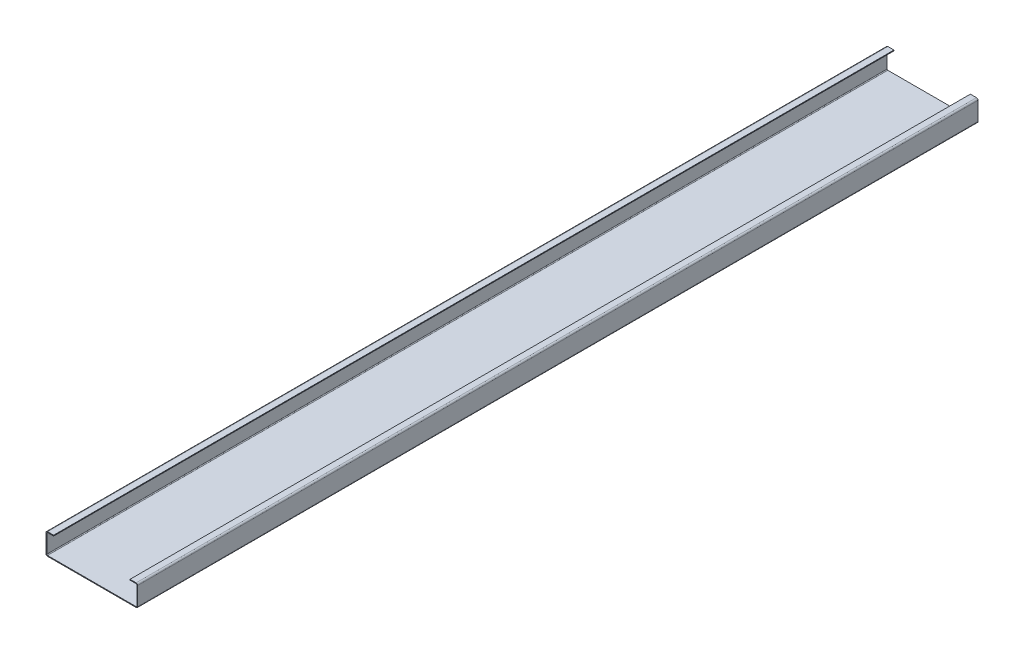
ISO-10303-21;
HEADER;
FILE_DESCRIPTION(('STEP AP214'),'2;1');
FILE_NAME('part.step','',(''),(''),'','','');
FILE_SCHEMA(('AUTOMOTIVE_DESIGN { 1 0 10303 214 1 1 1 1 }'));
ENDSEC;
DATA;
#1=APPLICATION_CONTEXT('core data for automotive mechanical design processes');
#2=APPLICATION_PROTOCOL_DEFINITION('international standard','automotive_design',2000,#1);
#3=PRODUCT_CONTEXT('',#1,'mechanical');
#4=PRODUCT('Part','Part','',(#3));
#5=PRODUCT_RELATED_PRODUCT_CATEGORY('part','',(#4));
#6=PRODUCT_DEFINITION_FORMATION('','',#4);
#7=PRODUCT_DEFINITION_CONTEXT('part definition',#1,'design');
#8=PRODUCT_DEFINITION('design','',#6,#7);
#9=PRODUCT_DEFINITION_SHAPE('','',#8);
#10=(LENGTH_UNIT() NAMED_UNIT(*) SI_UNIT(.MILLI.,.METRE.));
#11=(NAMED_UNIT(*) PLANE_ANGLE_UNIT() SI_UNIT($,.RADIAN.));
#12=(NAMED_UNIT(*) SI_UNIT($,.STERADIAN.) SOLID_ANGLE_UNIT());
#13=UNCERTAINTY_MEASURE_WITH_UNIT(LENGTH_MEASURE(1.E-05),#10,'distance_accuracy_value','');
#14=(GEOMETRIC_REPRESENTATION_CONTEXT(3) GLOBAL_UNCERTAINTY_ASSIGNED_CONTEXT((#13)) GLOBAL_UNIT_ASSIGNED_CONTEXT((#10,
#11,#12)) REPRESENTATION_CONTEXT('',''));
#15=CARTESIAN_POINT('',(0.,0.,0.));
#16=DIRECTION('',(0.,0.,1.));
#17=DIRECTION('',(1.,0.,0.));
#18=AXIS2_PLACEMENT_3D('',#15,#16,#17);
#19=CARTESIAN_POINT('',(-40.,0.,5500.));
#20=DIRECTION('',(0.,0.,1.));
#21=DIRECTION('',(1.,0.,0.));
#22=AXIS2_PLACEMENT_3D('',#19,#20,#21);
#23=PLANE('',#22);
#24=DIRECTION('',(0.,-1.,0.));
#25=VECTOR('',#24,1.);
#26=CARTESIAN_POINT('',(-40.,0.,5500.));
#27=LINE('',#26,#25);
#28=CARTESIAN_POINT('',(-40.,0.,5500.));
#29=VERTEX_POINT('',#28);
#30=CARTESIAN_POINT('',(-40.,-5.,5500.));
#31=VERTEX_POINT('',#30);
#32=EDGE_CURVE('E11',#29,#31,#27,.T.);
#33=ORIENTED_EDGE('',*,*,#32,.F.);
#34=CARTESIAN_POINT('',(-40.,-10.,5500.));
#35=DIRECTION('',(0.,0.,-1.));
#36=DIRECTION('',(-1.,0.,0.));
#37=AXIS2_PLACEMENT_3D('',#34,#35,#36);
#38=CIRCLE('',#37,10.);
#39=CARTESIAN_POINT('',(-50.,-10.,5500.));
#40=VERTEX_POINT('',#39);
#41=EDGE_CURVE('E363',#29,#40,#38,.F.);
#42=ORIENTED_EDGE('',*,*,#41,.T.);
#43=DIRECTION('',(-1.,0.,0.));
#44=VECTOR('',#43,1.);
#45=CARTESIAN_POINT('',(-45.,-10.,5500.));
#46=LINE('',#45,#44);
#47=CARTESIAN_POINT('',(-45.,-10.,5500.));
#48=VERTEX_POINT('',#47);
#49=EDGE_CURVE('E46',#48,#40,#46,.T.);
#50=ORIENTED_EDGE('',*,*,#49,.F.);
#51=CARTESIAN_POINT('',(-40.,-10.,5500.));
#52=DIRECTION('',(0.,0.,1.));
#53=DIRECTION('',(1.,0.,0.));
#54=AXIS2_PLACEMENT_3D('',#51,#52,#53);
#55=CIRCLE('',#54,5.);
#56=EDGE_CURVE('E438',#31,#48,#55,.T.);
#57=ORIENTED_EDGE('',*,*,#56,.F.);
#58=EDGE_LOOP('',(#33,#42,#50,#57));
#59=FACE_BOUND('',#58,.T.);
#60=ADVANCED_FACE('F38',(#59),#23,.T.);
#61=CARTESIAN_POINT('',(-45.,-10.,5500.));
#62=DIRECTION('',(0.,0.,1.));
#63=DIRECTION('',(1.,0.,0.));
#64=AXIS2_PLACEMENT_3D('',#61,#62,#63);
#65=PLANE('',#64);
#66=DIRECTION('',(-1.,0.,0.));
#67=VECTOR('',#66,1.);
#68=CARTESIAN_POINT('',(0.,0.,5500.));
#69=LINE('',#68,#67);
#70=CARTESIAN_POINT('',(0.,0.,5500.));
#71=VERTEX_POINT('',#70);
#72=EDGE_CURVE('E367',#71,#29,#69,.T.);
#73=ORIENTED_EDGE('',*,*,#72,.T.);
#74=ORIENTED_EDGE('',*,*,#32,.T.);
#75=DIRECTION('',(1.,0.,0.));
#76=VECTOR('',#75,1.);
#77=CARTESIAN_POINT('',(0.,-5.,5500.));
#78=LINE('',#77,#76);
#79=CARTESIAN_POINT('',(0.,-5.,5500.));
#80=VERTEX_POINT('',#79);
#81=EDGE_CURVE('E440',#80,#31,#78,.F.);
#82=ORIENTED_EDGE('',*,*,#81,.F.);
#83=DIRECTION('',(0.,-1.,0.));
#84=VECTOR('',#83,1.);
#85=CARTESIAN_POINT('',(0.,0.,5500.));
#86=LINE('',#85,#84);
#87=EDGE_CURVE('E443',#71,#80,#86,.T.);
#88=ORIENTED_EDGE('',*,*,#87,.F.);
#89=EDGE_LOOP('',(#73,#74,#82,#88));
#90=FACE_BOUND('',#89,.T.);
#91=ADVANCED_FACE('F449',(#90),#65,.T.);
#92=CARTESIAN_POINT('',(-50.,-10.,0.));
#93=DIRECTION('',(0.,0.,-1.));
#94=DIRECTION('',(-1.,0.,0.));
#95=AXIS2_PLACEMENT_3D('',#92,#93,#94);
#96=PLANE('',#95);
#97=DIRECTION('',(1.,0.,0.));
#98=VECTOR('',#97,1.);
#99=CARTESIAN_POINT('',(-50.,-10.,0.));
#100=LINE('',#99,#98);
#101=CARTESIAN_POINT('',(-50.,-10.,0.));
#102=VERTEX_POINT('',#101);
#103=CARTESIAN_POINT('',(-45.,-10.,0.));
#104=VERTEX_POINT('',#103);
#105=EDGE_CURVE('E347',#102,#104,#100,.T.);
#106=ORIENTED_EDGE('',*,*,#105,.F.);
#107=CARTESIAN_POINT('',(-40.,-10.,0.));
#108=DIRECTION('',(0.,0.,-1.));
#109=DIRECTION('',(-1.,0.,0.));
#110=AXIS2_PLACEMENT_3D('',#107,#108,#109);
#111=CIRCLE('',#110,10.);
#112=CARTESIAN_POINT('',(-40.,0.,0.));
#113=VERTEX_POINT('',#112);
#114=EDGE_CURVE('E263',#113,#102,#111,.F.);
#115=ORIENTED_EDGE('',*,*,#114,.F.);
#116=DIRECTION('',(0.,1.,0.));
#117=VECTOR('',#116,1.);
#118=CARTESIAN_POINT('',(-40.,-5.,0.));
#119=LINE('',#118,#117);
#120=CARTESIAN_POINT('',(-40.,-5.,0.));
#121=VERTEX_POINT('',#120);
#122=EDGE_CURVE('E345',#121,#113,#119,.T.);
#123=ORIENTED_EDGE('',*,*,#122,.F.);
#124=CARTESIAN_POINT('',(-40.,-10.,0.));
#125=DIRECTION('',(0.,0.,1.));
#126=DIRECTION('',(1.,0.,0.));
#127=AXIS2_PLACEMENT_3D('',#124,#125,#126);
#128=CIRCLE('',#127,5.);
#129=EDGE_CURVE('E251',#121,#104,#128,.T.);
#130=ORIENTED_EDGE('',*,*,#129,.T.);
#131=EDGE_LOOP('',(#106,#115,#123,#130));
#132=FACE_BOUND('',#131,.T.);
#133=ADVANCED_FACE('F456',(#132),#96,.T.);
#134=CARTESIAN_POINT('',(-40.,-5.,0.));
#135=DIRECTION('',(0.,0.,-1.));
#136=DIRECTION('',(-1.,0.,0.));
#137=AXIS2_PLACEMENT_3D('',#134,#135,#136);
#138=PLANE('',#137);
#139=DIRECTION('',(0.,-1.,0.));
#140=VECTOR('',#139,1.);
#141=CARTESIAN_POINT('',(-50.,0.,0.));
#142=LINE('',#141,#140);
#143=CARTESIAN_POINT('',(-50.,-130.,0.));
#144=VERTEX_POINT('',#143);
#145=EDGE_CURVE('E266',#102,#144,#142,.T.);
#146=ORIENTED_EDGE('',*,*,#145,.F.);
#147=ORIENTED_EDGE('',*,*,#105,.T.);
#148=DIRECTION('',(0.,-1.,0.));
#149=VECTOR('',#148,1.);
#150=CARTESIAN_POINT('',(-45.,0.,0.));
#151=LINE('',#150,#149);
#152=CARTESIAN_POINT('',(-45.,-130.,0.));
#153=VERTEX_POINT('',#152);
#154=EDGE_CURVE('E248',#104,#153,#151,.T.);
#155=ORIENTED_EDGE('',*,*,#154,.T.);
#156=DIRECTION('',(-1.,0.,0.));
#157=VECTOR('',#156,1.);
#158=CARTESIAN_POINT('',(-45.,-130.,0.));
#159=LINE('',#158,#157);
#160=EDGE_CURVE('E337',#153,#144,#159,.T.);
#161=ORIENTED_EDGE('',*,*,#160,.T.);
#162=EDGE_LOOP('',(#146,#147,#155,#161));
#163=FACE_BOUND('',#162,.T.);
#164=ADVANCED_FACE('F459',(#163),#138,.T.);
#165=CARTESIAN_POINT('',(-50.,-130.,5500.));
#166=DIRECTION('',(0.,0.,1.));
#167=DIRECTION('',(1.,0.,0.));
#168=AXIS2_PLACEMENT_3D('',#165,#166,#167);
#169=PLANE('',#168);
#170=DIRECTION('',(1.,0.,0.));
#171=VECTOR('',#170,1.);
#172=CARTESIAN_POINT('',(-50.,-130.,5500.));
#173=LINE('',#172,#171);
#174=CARTESIAN_POINT('',(-50.,-130.,5500.));
#175=VERTEX_POINT('',#174);
#176=CARTESIAN_POINT('',(-45.,-130.,5500.));
#177=VERTEX_POINT('',#176);
#178=EDGE_CURVE('E343',#175,#177,#173,.T.);
#179=ORIENTED_EDGE('',*,*,#178,.F.);
#180=CARTESIAN_POINT('',(-40.,-130.,5500.));
#181=DIRECTION('',(0.,0.,-1.));
#182=DIRECTION('',(-1.,0.,0.));
#183=AXIS2_PLACEMENT_3D('',#180,#181,#182);
#184=CIRCLE('',#183,10.);
#185=CARTESIAN_POINT('',(-40.,-140.,5500.));
#186=VERTEX_POINT('',#185);
#187=EDGE_CURVE('E375',#175,#186,#184,.F.);
#188=ORIENTED_EDGE('',*,*,#187,.T.);
#189=DIRECTION('',(0.,-1.,0.));
#190=VECTOR('',#189,1.);
#191=CARTESIAN_POINT('',(-40.,-135.,5500.));
#192=LINE('',#191,#190);
#193=CARTESIAN_POINT('',(-40.,-135.,5500.));
#194=VERTEX_POINT('',#193);
#195=EDGE_CURVE('E341',#194,#186,#192,.T.);
#196=ORIENTED_EDGE('',*,*,#195,.F.);
#197=CARTESIAN_POINT('',(-40.,-130.,5500.));
#198=DIRECTION('',(0.,0.,1.));
#199=DIRECTION('',(1.,0.,0.));
#200=AXIS2_PLACEMENT_3D('',#197,#198,#199);
#201=CIRCLE('',#200,5.);
#202=EDGE_CURVE('E434',#177,#194,#201,.T.);
#203=ORIENTED_EDGE('',*,*,#202,.F.);
#204=EDGE_LOOP('',(#179,#188,#196,#203));
#205=FACE_BOUND('',#204,.T.);
#206=ADVANCED_FACE('F479',(#205),#169,.T.);
#207=CARTESIAN_POINT('',(-40.,-135.,5500.));
#208=DIRECTION('',(0.,0.,1.));
#209=DIRECTION('',(1.,0.,0.));
#210=AXIS2_PLACEMENT_3D('',#207,#208,#209);
#211=PLANE('',#210);
#212=DIRECTION('',(0.,-1.,0.));
#213=VECTOR('',#212,1.);
#214=CARTESIAN_POINT('',(-50.,0.,5500.));
#215=LINE('',#214,#213);
#216=EDGE_CURVE('E354',#40,#175,#215,.T.);
#217=ORIENTED_EDGE('',*,*,#216,.T.);
#218=ORIENTED_EDGE('',*,*,#178,.T.);
#219=DIRECTION('',(0.,-1.,0.));
#220=VECTOR('',#219,1.);
#221=CARTESIAN_POINT('',(-45.,0.,5500.));
#222=LINE('',#221,#220);
#223=EDGE_CURVE('E357',#48,#177,#222,.T.);
#224=ORIENTED_EDGE('',*,*,#223,.F.);
#225=ORIENTED_EDGE('',*,*,#49,.T.);
#226=EDGE_LOOP('',(#217,#218,#224,#225));
#227=FACE_BOUND('',#226,.T.);
#228=ADVANCED_FACE('F352',(#227),#211,.T.);
#229=CARTESIAN_POINT('',(-40.,-140.,0.));
#230=DIRECTION('',(0.,0.,-1.));
#231=DIRECTION('',(-1.,0.,0.));
#232=AXIS2_PLACEMENT_3D('',#229,#230,#231);
#233=PLANE('',#232);
#234=DIRECTION('',(0.,1.,0.));
#235=VECTOR('',#234,1.);
#236=CARTESIAN_POINT('',(-40.,-140.,0.));
#237=LINE('',#236,#235);
#238=CARTESIAN_POINT('',(-40.,-140.,0.));
#239=VERTEX_POINT('',#238);
#240=CARTESIAN_POINT('',(-40.,-135.,0.));
#241=VERTEX_POINT('',#240);
#242=EDGE_CURVE('E339',#239,#241,#237,.T.);
#243=ORIENTED_EDGE('',*,*,#242,.F.);
#244=CARTESIAN_POINT('',(-40.,-130.,0.));
#245=DIRECTION('',(0.,0.,-1.));
#246=DIRECTION('',(-1.,0.,0.));
#247=AXIS2_PLACEMENT_3D('',#244,#245,#246);
#248=CIRCLE('',#247,10.);
#249=EDGE_CURVE('E269',#144,#239,#248,.F.);
#250=ORIENTED_EDGE('',*,*,#249,.F.);
#251=ORIENTED_EDGE('',*,*,#160,.F.);
#252=CARTESIAN_POINT('',(-40.,-130.,0.));
#253=DIRECTION('',(0.,0.,1.));
#254=DIRECTION('',(1.,0.,0.));
#255=AXIS2_PLACEMENT_3D('',#252,#253,#254);
#256=CIRCLE('',#255,5.);
#257=EDGE_CURVE('E245',#153,#241,#256,.T.);
#258=ORIENTED_EDGE('',*,*,#257,.T.);
#259=EDGE_LOOP('',(#243,#250,#251,#258));
#260=FACE_BOUND('',#259,.T.);
#261=ADVANCED_FACE('F473',(#260),#233,.T.);
#262=CARTESIAN_POINT('',(-45.,-130.,0.));
#263=DIRECTION('',(0.,0.,-1.));
#264=DIRECTION('',(-1.,0.,0.));
#265=AXIS2_PLACEMENT_3D('',#262,#263,#264);
#266=PLANE('',#265);
#267=DIRECTION('',(1.,0.,0.));
#268=VECTOR('',#267,1.);
#269=CARTESIAN_POINT('',(-50.,-140.,0.));
#270=LINE('',#269,#268);
#271=CARTESIAN_POINT('',(540.,-140.,0.));
#272=VERTEX_POINT('',#271);
#273=EDGE_CURVE('E272',#239,#272,#270,.T.);
#274=ORIENTED_EDGE('',*,*,#273,.F.);
#275=ORIENTED_EDGE('',*,*,#242,.T.);
#276=DIRECTION('',(1.,0.,0.));
#277=VECTOR('',#276,1.);
#278=CARTESIAN_POINT('',(-50.,-135.,0.));
#279=LINE('',#278,#277);
#280=CARTESIAN_POINT('',(540.,-135.,0.));
#281=VERTEX_POINT('',#280);
#282=EDGE_CURVE('E242',#241,#281,#279,.T.);
#283=ORIENTED_EDGE('',*,*,#282,.T.);
#284=DIRECTION('',(0.,-1.,0.));
#285=VECTOR('',#284,1.);
#286=CARTESIAN_POINT('',(540.,-135.,0.));
#287=LINE('',#286,#285);
#288=EDGE_CURVE('E333',#281,#272,#287,.T.);
#289=ORIENTED_EDGE('',*,*,#288,.T.);
#290=EDGE_LOOP('',(#274,#275,#283,#289));
#291=FACE_BOUND('',#290,.T.);
#292=ADVANCED_FACE('F483',(#291),#266,.T.);
#293=CARTESIAN_POINT('',(540.,-140.,5500.));
#294=DIRECTION('',(0.,0.,1.));
#295=DIRECTION('',(1.,0.,0.));
#296=AXIS2_PLACEMENT_3D('',#293,#294,#295);
#297=PLANE('',#296);
#298=DIRECTION('',(0.,1.,0.));
#299=VECTOR('',#298,1.);
#300=CARTESIAN_POINT('',(540.,-140.,5500.));
#301=LINE('',#300,#299);
#302=CARTESIAN_POINT('',(540.,-140.,5500.));
#303=VERTEX_POINT('',#302);
#304=CARTESIAN_POINT('',(540.,-135.,5500.));
#305=VERTEX_POINT('',#304);
#306=EDGE_CURVE('E195',#303,#305,#301,.T.);
#307=ORIENTED_EDGE('',*,*,#306,.F.);
#308=CARTESIAN_POINT('',(540.,-130.,5500.));
#309=DIRECTION('',(0.,0.,-1.));
#310=DIRECTION('',(-1.,0.,0.));
#311=AXIS2_PLACEMENT_3D('',#308,#309,#310);
#312=CIRCLE('',#311,10.);
#313=CARTESIAN_POINT('',(550.,-130.,5500.));
#314=VERTEX_POINT('',#313);
#315=EDGE_CURVE('E199',#303,#314,#312,.F.);
#316=ORIENTED_EDGE('',*,*,#315,.T.);
#317=DIRECTION('',(1.,0.,0.));
#318=VECTOR('',#317,1.);
#319=CARTESIAN_POINT('',(545.,-130.,5500.));
#320=LINE('',#319,#318);
#321=CARTESIAN_POINT('',(545.,-130.,5500.));
#322=VERTEX_POINT('',#321);
#323=EDGE_CURVE('E183',#322,#314,#320,.T.);
#324=ORIENTED_EDGE('',*,*,#323,.F.);
#325=CARTESIAN_POINT('',(540.,-130.,5500.));
#326=DIRECTION('',(0.,0.,1.));
#327=DIRECTION('',(1.,0.,0.));
#328=AXIS2_PLACEMENT_3D('',#325,#326,#327);
#329=CIRCLE('',#328,5.);
#330=EDGE_CURVE('E396',#305,#322,#329,.T.);
#331=ORIENTED_EDGE('',*,*,#330,.F.);
#332=EDGE_LOOP('',(#307,#316,#324,#331));
#333=FACE_BOUND('',#332,.T.);
#334=ADVANCED_FACE('F201',(#333),#297,.T.);
#335=CARTESIAN_POINT('',(545.,-130.,5500.));
#336=DIRECTION('',(0.,0.,1.));
#337=DIRECTION('',(1.,0.,0.));
#338=AXIS2_PLACEMENT_3D('',#335,#336,#337);
#339=PLANE('',#338);
#340=DIRECTION('',(1.,0.,0.));
#341=VECTOR('',#340,1.);
#342=CARTESIAN_POINT('',(-50.,-140.,5500.));
#343=LINE('',#342,#341);
#344=EDGE_CURVE('E205',#186,#303,#343,.T.);
#345=ORIENTED_EDGE('',*,*,#344,.T.);
#346=ORIENTED_EDGE('',*,*,#306,.T.);
#347=DIRECTION('',(1.,0.,0.));
#348=VECTOR('',#347,1.);
#349=CARTESIAN_POINT('',(-50.,-135.,5500.));
#350=LINE('',#349,#348);
#351=EDGE_CURVE('E431',#194,#305,#350,.T.);
#352=ORIENTED_EDGE('',*,*,#351,.F.);
#353=ORIENTED_EDGE('',*,*,#195,.T.);
#354=EDGE_LOOP('',(#345,#346,#352,#353));
#355=FACE_BOUND('',#354,.T.);
#356=ADVANCED_FACE('F383',(#355),#339,.T.);
#357=CARTESIAN_POINT('',(550.,-130.,0.));
#358=DIRECTION('',(0.,0.,-1.));
#359=DIRECTION('',(-1.,0.,0.));
#360=AXIS2_PLACEMENT_3D('',#357,#358,#359);
#361=PLANE('',#360);
#362=DIRECTION('',(-1.,0.,0.));
#363=VECTOR('',#362,1.);
#364=CARTESIAN_POINT('',(550.,-130.,0.));
#365=LINE('',#364,#363);
#366=CARTESIAN_POINT('',(550.,-130.,0.));
#367=VERTEX_POINT('',#366);
#368=CARTESIAN_POINT('',(545.,-130.,0.));
#369=VERTEX_POINT('',#368);
#370=EDGE_CURVE('E196',#367,#369,#365,.T.);
#371=ORIENTED_EDGE('',*,*,#370,.F.);
#372=CARTESIAN_POINT('',(540.,-130.,0.));
#373=DIRECTION('',(0.,0.,-1.));
#374=DIRECTION('',(-1.,0.,0.));
#375=AXIS2_PLACEMENT_3D('',#372,#373,#374);
#376=CIRCLE('',#375,10.);
#377=EDGE_CURVE('E212',#272,#367,#376,.F.);
#378=ORIENTED_EDGE('',*,*,#377,.F.);
#379=ORIENTED_EDGE('',*,*,#288,.F.);
#380=CARTESIAN_POINT('',(540.,-130.,0.));
#381=DIRECTION('',(0.,0.,1.));
#382=DIRECTION('',(1.,0.,0.));
#383=AXIS2_PLACEMENT_3D('',#380,#381,#382);
#384=CIRCLE('',#383,5.);
#385=EDGE_CURVE('E239',#281,#369,#384,.T.);
#386=ORIENTED_EDGE('',*,*,#385,.T.);
#387=EDGE_LOOP('',(#371,#378,#379,#386));
#388=FACE_BOUND('',#387,.T.);
#389=ADVANCED_FACE('F390',(#388),#361,.T.);
#390=CARTESIAN_POINT('',(540.,-135.,0.));
#391=DIRECTION('',(0.,0.,-1.));
#392=DIRECTION('',(-1.,0.,0.));
#393=AXIS2_PLACEMENT_3D('',#390,#391,#392);
#394=PLANE('',#393);
#395=DIRECTION('',(0.,1.,0.));
#396=VECTOR('',#395,1.);
#397=CARTESIAN_POINT('',(550.,-140.,0.));
#398=LINE('',#397,#396);
#399=CARTESIAN_POINT('',(550.,-9.99999999999998,0.));
#400=VERTEX_POINT('',#399);
#401=EDGE_CURVE('E276',#367,#400,#398,.T.);
#402=ORIENTED_EDGE('',*,*,#401,.F.);
#403=ORIENTED_EDGE('',*,*,#370,.T.);
#404=DIRECTION('',(0.,1.,0.));
#405=VECTOR('',#404,1.);
#406=CARTESIAN_POINT('',(545.,-140.,0.));
#407=LINE('',#406,#405);
#408=CARTESIAN_POINT('',(545.,-9.99999999999998,0.));
#409=VERTEX_POINT('',#408);
#410=EDGE_CURVE('E237',#369,#409,#407,.T.);
#411=ORIENTED_EDGE('',*,*,#410,.T.);
#412=DIRECTION('',(1.,0.,0.));
#413=VECTOR('',#412,1.);
#414=CARTESIAN_POINT('',(545.,-9.99999999999998,0.));
#415=LINE('',#414,#413);
#416=EDGE_CURVE('E119',#409,#400,#415,.T.);
#417=ORIENTED_EDGE('',*,*,#416,.T.);
#418=EDGE_LOOP('',(#402,#403,#411,#417));
#419=FACE_BOUND('',#418,.T.);
#420=ADVANCED_FACE('F392',(#419),#394,.T.);
#421=CARTESIAN_POINT('',(550.,-9.99999999999998,5500.));
#422=DIRECTION('',(0.,0.,1.));
#423=DIRECTION('',(1.,0.,0.));
#424=AXIS2_PLACEMENT_3D('',#421,#422,#423);
#425=PLANE('',#424);
#426=DIRECTION('',(-1.,0.,0.));
#427=VECTOR('',#426,1.);
#428=CARTESIAN_POINT('',(550.,-9.99999999999998,5500.));
#429=LINE('',#428,#427);
#430=CARTESIAN_POINT('',(550.,-9.99999999999998,5500.));
#431=VERTEX_POINT('',#430);
#432=CARTESIAN_POINT('',(545.,-9.99999999999998,5500.));
#433=VERTEX_POINT('',#432);
#434=EDGE_CURVE('E331',#431,#433,#429,.T.);
#435=ORIENTED_EDGE('',*,*,#434,.F.);
#436=CARTESIAN_POINT('',(540.,-9.99999999999998,5500.));
#437=DIRECTION('',(0.,0.,-1.));
#438=DIRECTION('',(-1.,0.,0.));
#439=AXIS2_PLACEMENT_3D('',#436,#437,#438);
#440=CIRCLE('',#439,10.);
#441=CARTESIAN_POINT('',(540.,0.,5500.));
#442=VERTEX_POINT('',#441);
#443=EDGE_CURVE('E220',#431,#442,#440,.F.);
#444=ORIENTED_EDGE('',*,*,#443,.T.);
#445=DIRECTION('',(0.,1.,0.));
#446=VECTOR('',#445,1.);
#447=CARTESIAN_POINT('',(540.,-4.99999999999998,5500.));
#448=LINE('',#447,#446);
#449=CARTESIAN_POINT('',(540.,-4.99999999999998,5500.));
#450=VERTEX_POINT('',#449);
#451=EDGE_CURVE('E54',#450,#442,#448,.T.);
#452=ORIENTED_EDGE('',*,*,#451,.F.);
#453=CARTESIAN_POINT('',(540.,-9.99999999999998,5500.));
#454=DIRECTION('',(0.,0.,1.));
#455=DIRECTION('',(1.,0.,0.));
#456=AXIS2_PLACEMENT_3D('',#453,#454,#455);
#457=CIRCLE('',#456,5.);
#458=EDGE_CURVE('E424',#433,#450,#457,.T.);
#459=ORIENTED_EDGE('',*,*,#458,.F.);
#460=EDGE_LOOP('',(#435,#444,#452,#459));
#461=FACE_BOUND('',#460,.T.);
#462=ADVANCED_FACE('F554',(#461),#425,.T.);
#463=CARTESIAN_POINT('',(540.,-4.99999999999998,5500.));
#464=DIRECTION('',(0.,0.,1.));
#465=DIRECTION('',(1.,0.,0.));
#466=AXIS2_PLACEMENT_3D('',#463,#464,#465);
#467=PLANE('',#466);
#468=DIRECTION('',(0.,1.,0.));
#469=VECTOR('',#468,1.);
#470=CARTESIAN_POINT('',(550.,-140.,5500.));
#471=LINE('',#470,#469);
#472=EDGE_CURVE('E187',#314,#431,#471,.T.);
#473=ORIENTED_EDGE('',*,*,#472,.T.);
#474=ORIENTED_EDGE('',*,*,#434,.T.);
#475=DIRECTION('',(0.,1.,0.));
#476=VECTOR('',#475,1.);
#477=CARTESIAN_POINT('',(545.,-140.,5500.));
#478=LINE('',#477,#476);
#479=EDGE_CURVE('E190',#322,#433,#478,.T.);
#480=ORIENTED_EDGE('',*,*,#479,.F.);
#481=ORIENTED_EDGE('',*,*,#323,.T.);
#482=EDGE_LOOP('',(#473,#474,#480,#481));
#483=FACE_BOUND('',#482,.T.);
#484=ADVANCED_FACE('F185',(#483),#467,.T.);
#485=CARTESIAN_POINT('',(540.,0.,0.));
#486=DIRECTION('',(0.,0.,-1.));
#487=DIRECTION('',(-1.,0.,0.));
#488=AXIS2_PLACEMENT_3D('',#485,#486,#487);
#489=PLANE('',#488);
#490=DIRECTION('',(0.,-1.,0.));
#491=VECTOR('',#490,1.);
#492=CARTESIAN_POINT('',(540.,0.,0.));
#493=LINE('',#492,#491);
#494=CARTESIAN_POINT('',(540.,0.,0.));
#495=VERTEX_POINT('',#494);
#496=CARTESIAN_POINT('',(540.,-4.99999999999998,0.));
#497=VERTEX_POINT('',#496);
#498=EDGE_CURVE('E126',#495,#497,#493,.T.);
#499=ORIENTED_EDGE('',*,*,#498,.F.);
#500=CARTESIAN_POINT('',(540.,-9.99999999999998,0.));
#501=DIRECTION('',(0.,0.,-1.));
#502=DIRECTION('',(-1.,0.,0.));
#503=AXIS2_PLACEMENT_3D('',#500,#501,#502);
#504=CIRCLE('',#503,10.);
#505=EDGE_CURVE('E278',#400,#495,#504,.F.);
#506=ORIENTED_EDGE('',*,*,#505,.F.);
#507=ORIENTED_EDGE('',*,*,#416,.F.);
#508=CARTESIAN_POINT('',(540.,-9.99999999999998,0.));
#509=DIRECTION('',(0.,0.,1.));
#510=DIRECTION('',(1.,0.,0.));
#511=AXIS2_PLACEMENT_3D('',#508,#509,#510);
#512=CIRCLE('',#511,5.);
#513=EDGE_CURVE('E235',#409,#497,#512,.T.);
#514=ORIENTED_EDGE('',*,*,#513,.T.);
#515=EDGE_LOOP('',(#499,#506,#507,#514));
#516=FACE_BOUND('',#515,.T.);
#517=ADVANCED_FACE('F407',(#516),#489,.T.);
#518=CARTESIAN_POINT('',(545.,-9.99999999999998,0.));
#519=DIRECTION('',(0.,0.,-1.));
#520=DIRECTION('',(-1.,0.,0.));
#521=AXIS2_PLACEMENT_3D('',#518,#519,#520);
#522=PLANE('',#521);
#523=DIRECTION('',(-1.,0.,0.));
#524=VECTOR('',#523,1.);
#525=CARTESIAN_POINT('',(550.,0.,0.));
#526=LINE('',#525,#524);
#527=CARTESIAN_POINT('',(500.,0.,0.));
#528=VERTEX_POINT('',#527);
#529=EDGE_CURVE('E226',#495,#528,#526,.T.);
#530=ORIENTED_EDGE('',*,*,#529,.F.);
#531=ORIENTED_EDGE('',*,*,#498,.T.);
#532=DIRECTION('',(-1.,0.,0.));
#533=VECTOR('',#532,1.);
#534=CARTESIAN_POINT('',(550.,-4.99999999999997,0.));
#535=LINE('',#534,#533);
#536=CARTESIAN_POINT('',(500.,-5.00000000000001,0.));
#537=VERTEX_POINT('',#536);
#538=EDGE_CURVE('E232',#497,#537,#535,.T.);
#539=ORIENTED_EDGE('',*,*,#538,.T.);
#540=DIRECTION('',(0.,1.,0.));
#541=VECTOR('',#540,1.);
#542=CARTESIAN_POINT('',(500.,-5.00000000000001,0.));
#543=LINE('',#542,#541);
#544=EDGE_CURVE('E229',#537,#528,#543,.T.);
#545=ORIENTED_EDGE('',*,*,#544,.T.);
#546=EDGE_LOOP('',(#530,#531,#539,#545));
#547=FACE_BOUND('',#546,.T.);
#548=ADVANCED_FACE('F415',(#547),#522,.T.);
#549=CARTESIAN_POINT('',(550.,0.,5500.));
#550=DIRECTION('',(0.,-1.,0.));
#551=DIRECTION('',(1.,0.,0.));
#552=AXIS2_PLACEMENT_3D('',#549,#550,#551);
#553=PLANE('',#552);
#554=ORIENTED_EDGE('',*,*,#529,.T.);
#555=DIRECTION('',(0.,0.,-1.));
#556=VECTOR('',#555,1.);
#557=CARTESIAN_POINT('',(500.,0.,5500.));
#558=LINE('',#557,#556);
#559=CARTESIAN_POINT('',(500.,0.,5500.));
#560=VERTEX_POINT('',#559);
#561=EDGE_CURVE('E326',#560,#528,#558,.T.);
#562=ORIENTED_EDGE('',*,*,#561,.F.);
#563=DIRECTION('',(-1.,0.,0.));
#564=VECTOR('',#563,1.);
#565=CARTESIAN_POINT('',(550.,0.,5500.));
#566=LINE('',#565,#564);
#567=EDGE_CURVE('E132',#442,#560,#566,.T.);
#568=ORIENTED_EDGE('',*,*,#567,.F.);
#569=DIRECTION('',(0.,0.,-1.));
#570=VECTOR('',#569,1.);
#571=CARTESIAN_POINT('',(540.,0.,5500.));
#572=LINE('',#571,#570);
#573=EDGE_CURVE('E222',#442,#495,#572,.T.);
#574=ORIENTED_EDGE('',*,*,#573,.T.);
#575=EDGE_LOOP('',(#554,#562,#568,#574));
#576=FACE_BOUND('',#575,.T.);
#577=ADVANCED_FACE('F413',(#576),#553,.F.);
#578=CARTESIAN_POINT('',(500.,-5.00000000000001,5500.));
#579=DIRECTION('',(-1.,0.,0.));
#580=DIRECTION('',(0.,0.,1.));
#581=AXIS2_PLACEMENT_3D('',#578,#579,#580);
#582=PLANE('',#581);
#583=ORIENTED_EDGE('',*,*,#544,.F.);
#584=DIRECTION('',(0.,0.,-1.));
#585=VECTOR('',#584,1.);
#586=CARTESIAN_POINT('',(500.,-5.00000000000001,5500.));
#587=LINE('',#586,#585);
#588=CARTESIAN_POINT('',(500.,-5.00000000000001,5500.));
#589=VERTEX_POINT('',#588);
#590=EDGE_CURVE('E324',#589,#537,#587,.T.);
#591=ORIENTED_EDGE('',*,*,#590,.F.);
#592=DIRECTION('',(0.,1.,0.));
#593=VECTOR('',#592,1.);
#594=CARTESIAN_POINT('',(500.,-5.00000000000001,5500.));
#595=LINE('',#594,#593);
#596=EDGE_CURVE('E420',#589,#560,#595,.T.);
#597=ORIENTED_EDGE('',*,*,#596,.T.);
#598=ORIENTED_EDGE('',*,*,#561,.T.);
#599=EDGE_LOOP('',(#583,#591,#597,#598));
#600=FACE_BOUND('',#599,.T.);
#601=ADVANCED_FACE('F418',(#600),#582,.T.);
#602=CARTESIAN_POINT('',(550.,-4.99999999999997,5500.));
#603=DIRECTION('',(0.,-1.,0.));
#604=DIRECTION('',(1.,0.,0.));
#605=AXIS2_PLACEMENT_3D('',#602,#603,#604);
#606=PLANE('',#605);
#607=ORIENTED_EDGE('',*,*,#538,.F.);
#608=DIRECTION('',(0.,0.,-1.));
#609=VECTOR('',#608,1.);
#610=CARTESIAN_POINT('',(540.,-4.99999999999998,5500.));
#611=LINE('',#610,#609);
#612=EDGE_CURVE('E321',#450,#497,#611,.T.);
#613=ORIENTED_EDGE('',*,*,#612,.F.);
#614=DIRECTION('',(-1.,0.,0.));
#615=VECTOR('',#614,1.);
#616=CARTESIAN_POINT('',(550.,-4.99999999999997,5500.));
#617=LINE('',#616,#615);
#618=EDGE_CURVE('E422',#450,#589,#617,.T.);
#619=ORIENTED_EDGE('',*,*,#618,.T.);
#620=ORIENTED_EDGE('',*,*,#590,.T.);
#621=EDGE_LOOP('',(#607,#613,#619,#620));
#622=FACE_BOUND('',#621,.T.);
#623=ADVANCED_FACE('F610',(#622),#606,.T.);
#624=CARTESIAN_POINT('',(540.,-9.99999999999998,5500.));
#625=DIRECTION('',(0.,0.,-1.));
#626=DIRECTION('',(-1.,0.,0.));
#627=AXIS2_PLACEMENT_3D('',#624,#625,#626);
#628=CYLINDRICAL_SURFACE('',#627,5.);
#629=ORIENTED_EDGE('',*,*,#513,.F.);
#630=DIRECTION('',(0.,0.,-1.));
#631=VECTOR('',#630,1.);
#632=CARTESIAN_POINT('',(545.,-9.99999999999998,5500.));
#633=LINE('',#632,#631);
#634=EDGE_CURVE('E318',#433,#409,#633,.T.);
#635=ORIENTED_EDGE('',*,*,#634,.F.);
#636=ORIENTED_EDGE('',*,*,#458,.T.);
#637=ORIENTED_EDGE('',*,*,#612,.T.);
#638=EDGE_LOOP('',(#629,#635,#636,#637));
#639=FACE_BOUND('',#638,.T.);
#640=ADVANCED_FACE('F404',(#639),#628,.F.);
#641=CARTESIAN_POINT('',(545.,-140.,5500.));
#642=DIRECTION('',(-1.,0.,0.));
#643=DIRECTION('',(0.,0.,1.));
#644=AXIS2_PLACEMENT_3D('',#641,#642,#643);
#645=PLANE('',#644);
#646=ORIENTED_EDGE('',*,*,#410,.F.);
#647=DIRECTION('',(0.,0.,-1.));
#648=VECTOR('',#647,1.);
#649=CARTESIAN_POINT('',(545.,-130.,5500.));
#650=LINE('',#649,#648);
#651=EDGE_CURVE('E315',#322,#369,#650,.T.);
#652=ORIENTED_EDGE('',*,*,#651,.F.);
#653=ORIENTED_EDGE('',*,*,#479,.T.);
#654=ORIENTED_EDGE('',*,*,#634,.T.);
#655=EDGE_LOOP('',(#646,#652,#653,#654));
#656=FACE_BOUND('',#655,.T.);
#657=ADVANCED_FACE('F398',(#656),#645,.T.);
#658=CARTESIAN_POINT('',(540.,-130.,5500.));
#659=DIRECTION('',(0.,0.,-1.));
#660=DIRECTION('',(-1.,0.,0.));
#661=AXIS2_PLACEMENT_3D('',#658,#659,#660);
#662=CYLINDRICAL_SURFACE('',#661,5.);
#663=ORIENTED_EDGE('',*,*,#385,.F.);
#664=DIRECTION('',(0.,0.,-1.));
#665=VECTOR('',#664,1.);
#666=CARTESIAN_POINT('',(540.,-135.,5500.));
#667=LINE('',#666,#665);
#668=EDGE_CURVE('E312',#305,#281,#667,.T.);
#669=ORIENTED_EDGE('',*,*,#668,.F.);
#670=ORIENTED_EDGE('',*,*,#330,.T.);
#671=ORIENTED_EDGE('',*,*,#651,.T.);
#672=EDGE_LOOP('',(#663,#669,#670,#671));
#673=FACE_BOUND('',#672,.T.);
#674=ADVANCED_FACE('F395',(#673),#662,.F.);
#675=CARTESIAN_POINT('',(-50.,-135.,5500.));
#676=DIRECTION('',(0.,1.,0.));
#677=DIRECTION('',(0.,0.,1.));
#678=AXIS2_PLACEMENT_3D('',#675,#676,#677);
#679=PLANE('',#678);
#680=ORIENTED_EDGE('',*,*,#282,.F.);
#681=DIRECTION('',(0.,0.,-1.));
#682=VECTOR('',#681,1.);
#683=CARTESIAN_POINT('',(-40.,-135.,5500.));
#684=LINE('',#683,#682);
#685=EDGE_CURVE('E309',#194,#241,#684,.T.);
#686=ORIENTED_EDGE('',*,*,#685,.F.);
#687=ORIENTED_EDGE('',*,*,#351,.T.);
#688=ORIENTED_EDGE('',*,*,#668,.T.);
#689=EDGE_LOOP('',(#680,#686,#687,#688));
#690=FACE_BOUND('',#689,.T.);
#691=ADVANCED_FACE('F481',(#690),#679,.T.);
#692=CARTESIAN_POINT('',(-40.,-130.,5500.));
#693=DIRECTION('',(0.,0.,-1.));
#694=DIRECTION('',(-1.,0.,0.));
#695=AXIS2_PLACEMENT_3D('',#692,#693,#694);
#696=CYLINDRICAL_SURFACE('',#695,5.);
#697=ORIENTED_EDGE('',*,*,#257,.F.);
#698=DIRECTION('',(0.,0.,-1.));
#699=VECTOR('',#698,1.);
#700=CARTESIAN_POINT('',(-45.,-130.,5500.));
#701=LINE('',#700,#699);
#702=EDGE_CURVE('E306',#177,#153,#701,.T.);
#703=ORIENTED_EDGE('',*,*,#702,.F.);
#704=ORIENTED_EDGE('',*,*,#202,.T.);
#705=ORIENTED_EDGE('',*,*,#685,.T.);
#706=EDGE_LOOP('',(#697,#703,#704,#705));
#707=FACE_BOUND('',#706,.T.);
#708=ADVANCED_FACE('F469',(#707),#696,.F.);
#709=CARTESIAN_POINT('',(-45.,0.,5500.));
#710=DIRECTION('',(1.,0.,0.));
#711=DIRECTION('',(0.,1.,0.));
#712=AXIS2_PLACEMENT_3D('',#709,#710,#711);
#713=PLANE('',#712);
#714=ORIENTED_EDGE('',*,*,#154,.F.);
#715=DIRECTION('',(0.,0.,-1.));
#716=VECTOR('',#715,1.);
#717=CARTESIAN_POINT('',(-45.,-10.,5500.));
#718=LINE('',#717,#716);
#719=EDGE_CURVE('E303',#48,#104,#718,.T.);
#720=ORIENTED_EDGE('',*,*,#719,.F.);
#721=ORIENTED_EDGE('',*,*,#223,.T.);
#722=ORIENTED_EDGE('',*,*,#702,.T.);
#723=EDGE_LOOP('',(#714,#720,#721,#722));
#724=FACE_BOUND('',#723,.T.);
#725=ADVANCED_FACE('F464',(#724),#713,.T.);
#726=CARTESIAN_POINT('',(-40.,-10.,5500.));
#727=DIRECTION('',(0.,0.,-1.));
#728=DIRECTION('',(-1.,0.,0.));
#729=AXIS2_PLACEMENT_3D('',#726,#727,#728);
#730=CYLINDRICAL_SURFACE('',#729,5.);
#731=ORIENTED_EDGE('',*,*,#129,.F.);
#732=DIRECTION('',(0.,0.,-1.));
#733=VECTOR('',#732,1.);
#734=CARTESIAN_POINT('',(-40.,-5.,5500.));
#735=LINE('',#734,#733);
#736=EDGE_CURVE('E300',#31,#121,#735,.T.);
#737=ORIENTED_EDGE('',*,*,#736,.F.);
#738=ORIENTED_EDGE('',*,*,#56,.T.);
#739=ORIENTED_EDGE('',*,*,#719,.T.);
#740=EDGE_LOOP('',(#731,#737,#738,#739));
#741=FACE_BOUND('',#740,.T.);
#742=ADVANCED_FACE('F462',(#741),#730,.F.);
#743=CARTESIAN_POINT('',(0.,-5.,5500.));
#744=DIRECTION('',(0.,-1.,0.));
#745=DIRECTION('',(0.,0.,-1.));
#746=AXIS2_PLACEMENT_3D('',#743,#744,#745);
#747=PLANE('',#746);
#748=DIRECTION('',(1.,0.,0.));
#749=VECTOR('',#748,1.);
#750=CARTESIAN_POINT('',(0.,-5.,0.));
#751=LINE('',#750,#749);
#752=CARTESIAN_POINT('',(0.,-5.,0.));
#753=VERTEX_POINT('',#752);
#754=EDGE_CURVE('E254',#753,#121,#751,.F.);
#755=ORIENTED_EDGE('',*,*,#754,.F.);
#756=DIRECTION('',(0.,0.,-1.));
#757=VECTOR('',#756,1.);
#758=CARTESIAN_POINT('',(0.,-5.,5500.));
#759=LINE('',#758,#757);
#760=EDGE_CURVE('E298',#80,#753,#759,.T.);
#761=ORIENTED_EDGE('',*,*,#760,.F.);
#762=ORIENTED_EDGE('',*,*,#81,.T.);
#763=ORIENTED_EDGE('',*,*,#736,.T.);
#764=EDGE_LOOP('',(#755,#761,#762,#763));
#765=FACE_BOUND('',#764,.T.);
#766=ADVANCED_FACE('F684',(#765),#747,.T.);
#767=CARTESIAN_POINT('',(0.,0.,5500.));
#768=DIRECTION('',(1.,0.,0.));
#769=DIRECTION('',(0.,0.,-1.));
#770=AXIS2_PLACEMENT_3D('',#767,#768,#769);
#771=PLANE('',#770);
#772=DIRECTION('',(0.,-1.,0.));
#773=VECTOR('',#772,1.);
#774=CARTESIAN_POINT('',(0.,0.,0.));
#775=LINE('',#774,#773);
#776=CARTESIAN_POINT('',(0.,0.,0.));
#777=VERTEX_POINT('',#776);
#778=EDGE_CURVE('E257',#777,#753,#775,.T.);
#779=ORIENTED_EDGE('',*,*,#778,.F.);
#780=DIRECTION('',(0.,0.,-1.));
#781=VECTOR('',#780,1.);
#782=CARTESIAN_POINT('',(0.,0.,5500.));
#783=LINE('',#782,#781);
#784=EDGE_CURVE('E296',#71,#777,#783,.T.);
#785=ORIENTED_EDGE('',*,*,#784,.F.);
#786=ORIENTED_EDGE('',*,*,#87,.T.);
#787=ORIENTED_EDGE('',*,*,#760,.T.);
#788=EDGE_LOOP('',(#779,#785,#786,#787));
#789=FACE_BOUND('',#788,.T.);
#790=ADVANCED_FACE('F694',(#789),#771,.T.);
#791=CARTESIAN_POINT('',(0.,0.,5500.));
#792=DIRECTION('',(0.,-1.,0.));
#793=DIRECTION('',(0.,0.,-1.));
#794=AXIS2_PLACEMENT_3D('',#791,#792,#793);
#795=PLANE('',#794);
#796=DIRECTION('',(-1.,0.,0.));
#797=VECTOR('',#796,1.);
#798=CARTESIAN_POINT('',(0.,0.,0.));
#799=LINE('',#798,#797);
#800=EDGE_CURVE('E260',#777,#113,#799,.T.);
#801=ORIENTED_EDGE('',*,*,#800,.T.);
#802=DIRECTION('',(0.,0.,-1.));
#803=VECTOR('',#802,1.);
#804=CARTESIAN_POINT('',(-40.,0.,5500.));
#805=LINE('',#804,#803);
#806=EDGE_CURVE('E293',#29,#113,#805,.T.);
#807=ORIENTED_EDGE('',*,*,#806,.F.);
#808=ORIENTED_EDGE('',*,*,#72,.F.);
#809=ORIENTED_EDGE('',*,*,#784,.T.);
#810=EDGE_LOOP('',(#801,#807,#808,#809));
#811=FACE_BOUND('',#810,.T.);
#812=ADVANCED_FACE('F453',(#811),#795,.F.);
#813=CARTESIAN_POINT('',(-40.,-10.,5500.));
#814=DIRECTION('',(0.,0.,-1.));
#815=DIRECTION('',(-1.,0.,0.));
#816=AXIS2_PLACEMENT_3D('',#813,#814,#815);
#817=CYLINDRICAL_SURFACE('',#816,10.);
#818=ORIENTED_EDGE('',*,*,#114,.T.);
#819=DIRECTION('',(0.,0.,-1.));
#820=VECTOR('',#819,1.);
#821=CARTESIAN_POINT('',(-50.,-10.,5500.));
#822=LINE('',#821,#820);
#823=EDGE_CURVE('E290',#40,#102,#822,.T.);
#824=ORIENTED_EDGE('',*,*,#823,.F.);
#825=ORIENTED_EDGE('',*,*,#41,.F.);
#826=ORIENTED_EDGE('',*,*,#806,.T.);
#827=EDGE_LOOP('',(#818,#824,#825,#826));
#828=FACE_BOUND('',#827,.T.);
#829=ADVANCED_FACE('F369',(#828),#817,.T.);
#830=CARTESIAN_POINT('',(-50.,0.,5500.));
#831=DIRECTION('',(1.,0.,0.));
#832=DIRECTION('',(0.,1.,0.));
#833=AXIS2_PLACEMENT_3D('',#830,#831,#832);
#834=PLANE('',#833);
#835=ORIENTED_EDGE('',*,*,#145,.T.);
#836=DIRECTION('',(0.,0.,-1.));
#837=VECTOR('',#836,1.);
#838=CARTESIAN_POINT('',(-50.,-130.,5500.));
#839=LINE('',#838,#837);
#840=EDGE_CURVE('E287',#175,#144,#839,.T.);
#841=ORIENTED_EDGE('',*,*,#840,.F.);
#842=ORIENTED_EDGE('',*,*,#216,.F.);
#843=ORIENTED_EDGE('',*,*,#823,.T.);
#844=EDGE_LOOP('',(#835,#841,#842,#843));
#845=FACE_BOUND('',#844,.T.);
#846=ADVANCED_FACE('F373',(#845),#834,.F.);
#847=CARTESIAN_POINT('',(-40.,-130.,5500.));
#848=DIRECTION('',(0.,0.,-1.));
#849=DIRECTION('',(-1.,0.,0.));
#850=AXIS2_PLACEMENT_3D('',#847,#848,#849);
#851=CYLINDRICAL_SURFACE('',#850,10.);
#852=ORIENTED_EDGE('',*,*,#249,.T.);
#853=DIRECTION('',(0.,0.,-1.));
#854=VECTOR('',#853,1.);
#855=CARTESIAN_POINT('',(-40.,-140.,5500.));
#856=LINE('',#855,#854);
#857=EDGE_CURVE('E284',#186,#239,#856,.T.);
#858=ORIENTED_EDGE('',*,*,#857,.F.);
#859=ORIENTED_EDGE('',*,*,#187,.F.);
#860=ORIENTED_EDGE('',*,*,#840,.T.);
#861=EDGE_LOOP('',(#852,#858,#859,#860));
#862=FACE_BOUND('',#861,.T.);
#863=ADVANCED_FACE('F476',(#862),#851,.T.);
#864=CARTESIAN_POINT('',(-50.,-140.,5500.));
#865=DIRECTION('',(0.,1.,0.));
#866=DIRECTION('',(0.,0.,1.));
#867=AXIS2_PLACEMENT_3D('',#864,#865,#866);
#868=PLANE('',#867);
#869=ORIENTED_EDGE('',*,*,#273,.T.);
#870=DIRECTION('',(0.,0.,-1.));
#871=VECTOR('',#870,1.);
#872=CARTESIAN_POINT('',(540.,-140.,5500.));
#873=LINE('',#872,#871);
#874=EDGE_CURVE('E214',#303,#272,#873,.T.);
#875=ORIENTED_EDGE('',*,*,#874,.F.);
#876=ORIENTED_EDGE('',*,*,#344,.F.);
#877=ORIENTED_EDGE('',*,*,#857,.T.);
#878=EDGE_LOOP('',(#869,#875,#876,#877));
#879=FACE_BOUND('',#878,.T.);
#880=ADVANCED_FACE('F387',(#879),#868,.F.);
#881=CARTESIAN_POINT('',(540.,-130.,5500.));
#882=DIRECTION('',(0.,0.,-1.));
#883=DIRECTION('',(-1.,0.,0.));
#884=AXIS2_PLACEMENT_3D('',#881,#882,#883);
#885=CYLINDRICAL_SURFACE('',#884,10.);
#886=ORIENTED_EDGE('',*,*,#377,.T.);
#887=DIRECTION('',(0.,0.,-1.));
#888=VECTOR('',#887,1.);
#889=CARTESIAN_POINT('',(550.,-130.,5500.));
#890=LINE('',#889,#888);
#891=EDGE_CURVE('E209',#314,#367,#890,.T.);
#892=ORIENTED_EDGE('',*,*,#891,.F.);
#893=ORIENTED_EDGE('',*,*,#315,.F.);
#894=ORIENTED_EDGE('',*,*,#874,.T.);
#895=EDGE_LOOP('',(#886,#892,#893,#894));
#896=FACE_BOUND('',#895,.T.);
#897=ADVANCED_FACE('F210',(#896),#885,.T.);
#898=CARTESIAN_POINT('',(550.,-140.,5500.));
#899=DIRECTION('',(-1.,0.,0.));
#900=DIRECTION('',(0.,0.,1.));
#901=AXIS2_PLACEMENT_3D('',#898,#899,#900);
#902=PLANE('',#901);
#903=ORIENTED_EDGE('',*,*,#401,.T.);
#904=DIRECTION('',(0.,0.,-1.));
#905=VECTOR('',#904,1.);
#906=CARTESIAN_POINT('',(550.,-9.99999999999998,5500.));
#907=LINE('',#906,#905);
#908=EDGE_CURVE('E215',#431,#400,#907,.T.);
#909=ORIENTED_EDGE('',*,*,#908,.F.);
#910=ORIENTED_EDGE('',*,*,#472,.F.);
#911=ORIENTED_EDGE('',*,*,#891,.T.);
#912=EDGE_LOOP('',(#903,#909,#910,#911));
#913=FACE_BOUND('',#912,.T.);
#914=ADVANCED_FACE('F217',(#913),#902,.F.);
#915=CARTESIAN_POINT('',(540.,-9.99999999999998,5500.));
#916=DIRECTION('',(0.,0.,-1.));
#917=DIRECTION('',(-1.,0.,0.));
#918=AXIS2_PLACEMENT_3D('',#915,#916,#917);
#919=CYLINDRICAL_SURFACE('',#918,10.);
#920=ORIENTED_EDGE('',*,*,#505,.T.);
#921=ORIENTED_EDGE('',*,*,#573,.F.);
#922=ORIENTED_EDGE('',*,*,#443,.F.);
#923=ORIENTED_EDGE('',*,*,#908,.T.);
#924=EDGE_LOOP('',(#920,#921,#922,#923));
#925=FACE_BOUND('',#924,.T.);
#926=ADVANCED_FACE('F410',(#925),#919,.T.);
#927=CARTESIAN_POINT('',(540.,-9.99999999999998,5500.));
#928=DIRECTION('',(0.,0.,1.));
#929=DIRECTION('',(1.,0.,0.));
#930=AXIS2_PLACEMENT_3D('',#927,#928,#929);
#931=PLANE('',#930);
#932=ORIENTED_EDGE('',*,*,#567,.T.);
#933=ORIENTED_EDGE('',*,*,#596,.F.);
#934=ORIENTED_EDGE('',*,*,#618,.F.);
#935=ORIENTED_EDGE('',*,*,#451,.T.);
#936=EDGE_LOOP('',(#932,#933,#934,#935));
#937=FACE_BOUND('',#936,.T.);
#938=ADVANCED_FACE('F778',(#937),#931,.T.);
#939=CARTESIAN_POINT('',(540.,-9.99999999999998,0.));
#940=DIRECTION('',(0.,0.,1.));
#941=DIRECTION('',(1.,0.,0.));
#942=AXIS2_PLACEMENT_3D('',#939,#940,#941);
#943=PLANE('',#942);
#944=ORIENTED_EDGE('',*,*,#754,.T.);
#945=ORIENTED_EDGE('',*,*,#122,.T.);
#946=ORIENTED_EDGE('',*,*,#800,.F.);
#947=ORIENTED_EDGE('',*,*,#778,.T.);
#948=EDGE_LOOP('',(#944,#945,#946,#947));
#949=FACE_BOUND('',#948,.T.);
#950=ADVANCED_FACE('F788',(#949),#943,.F.);
#951=CLOSED_SHELL('',(#60,#91,#133,#164,#206,#228,#261,#292,#334,#356,#389,#420,#462,#484,#517,
#548,#577,#601,#623,#640,#657,#674,#691,#708,#725,#742,#766,#790,#812,#829,#846,#863,#880,#897,
#914,#926,#938,#950));
#952=MANIFOLD_SOLID_BREP('B2',#951);
#953=ADVANCED_BREP_SHAPE_REPRESENTATION('',(#18,#952),#14);
#954=SHAPE_DEFINITION_REPRESENTATION(#9,#953);
ENDSEC;
END-ISO-10303-21;
